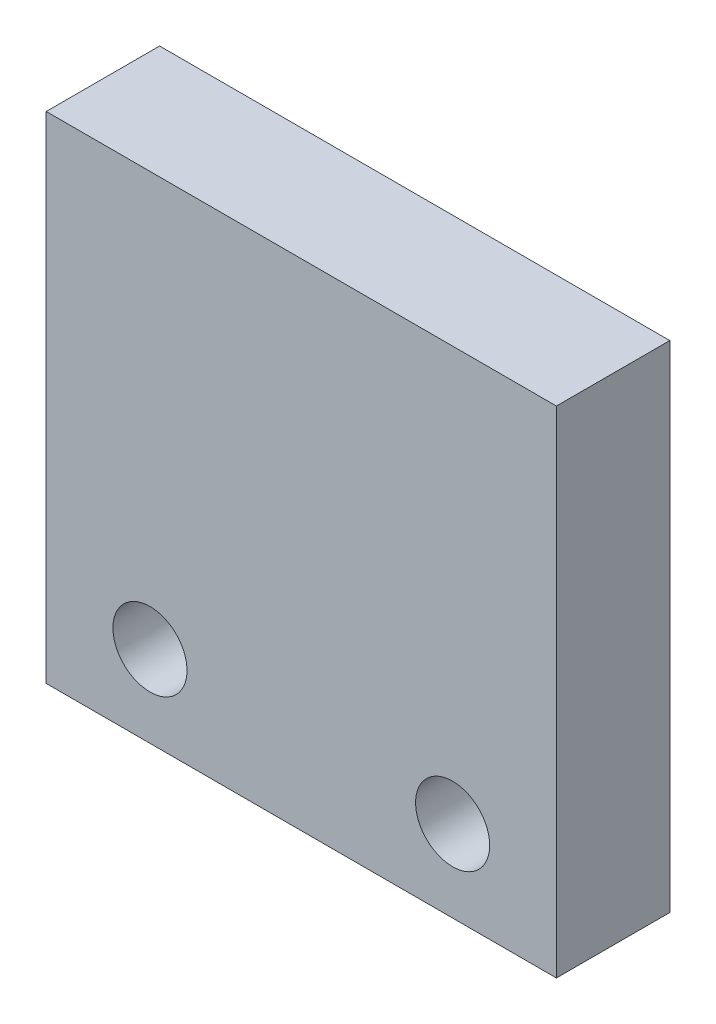
ISO-10303-21;
HEADER;
FILE_DESCRIPTION(('STEP AP214'),'2;1');
FILE_NAME('part.step','',(''),(''),'','','');
FILE_SCHEMA(('AUTOMOTIVE_DESIGN { 1 0 10303 214 1 1 1 1 }'));
ENDSEC;
DATA;
#1=APPLICATION_CONTEXT('core data for automotive mechanical design processes');
#2=APPLICATION_PROTOCOL_DEFINITION('international standard','automotive_design',2000,#1);
#3=PRODUCT_CONTEXT('',#1,'mechanical');
#4=PRODUCT('Part','Part','',(#3));
#5=PRODUCT_RELATED_PRODUCT_CATEGORY('part','',(#4));
#6=PRODUCT_DEFINITION_FORMATION('','',#4);
#7=PRODUCT_DEFINITION_CONTEXT('part definition',#1,'design');
#8=PRODUCT_DEFINITION('design','',#6,#7);
#9=PRODUCT_DEFINITION_SHAPE('','',#8);
#10=(LENGTH_UNIT() NAMED_UNIT(*) SI_UNIT(.MILLI.,.METRE.));
#11=(NAMED_UNIT(*) PLANE_ANGLE_UNIT() SI_UNIT($,.RADIAN.));
#12=(NAMED_UNIT(*) SI_UNIT($,.STERADIAN.) SOLID_ANGLE_UNIT());
#13=UNCERTAINTY_MEASURE_WITH_UNIT(LENGTH_MEASURE(1.E-05),#10,'distance_accuracy_value','');
#14=(GEOMETRIC_REPRESENTATION_CONTEXT(3) GLOBAL_UNCERTAINTY_ASSIGNED_CONTEXT((#13)) GLOBAL_UNIT_ASSIGNED_CONTEXT((#10,
#11,#12)) REPRESENTATION_CONTEXT('',''));
#15=CARTESIAN_POINT('',(0.,0.,0.));
#16=DIRECTION('',(0.,0.,1.));
#17=DIRECTION('',(1.,0.,0.));
#18=AXIS2_PLACEMENT_3D('',#15,#16,#17);
#19=CARTESIAN_POINT('',(0.,0.,7.65));
#20=DIRECTION('',(0.,0.,1.));
#21=DIRECTION('',(1.,0.,0.));
#22=AXIS2_PLACEMENT_3D('',#19,#20,#21);
#23=PLANE('',#22);
#24=CARTESIAN_POINT('',(10.21,-11.21,7.65));
#25=DIRECTION('',(0.,0.,1.));
#26=DIRECTION('',(1.,0.,0.));
#27=AXIS2_PLACEMENT_3D('',#24,#25,#26);
#28=CIRCLE('',#27,2.5);
#29=CARTESIAN_POINT('',(12.71,-11.21,7.65));
#30=VERTEX_POINT('',#29);
#31=EDGE_CURVE('E104',#30,#30,#28,.T.);
#32=ORIENTED_EDGE('',*,*,#31,.F.);
#33=EDGE_LOOP('',(#32));
#34=FACE_BOUND('',#33,.T.);
#35=DIRECTION('',(0.,1.,0.));
#36=VECTOR('',#35,1.);
#37=CARTESIAN_POINT('',(17.21,16.71,7.65));
#38=LINE('',#37,#36);
#39=CARTESIAN_POINT('',(17.21,-16.71,7.65));
#40=VERTEX_POINT('',#39);
#41=CARTESIAN_POINT('',(17.21,16.71,7.65));
#42=VERTEX_POINT('',#41);
#43=EDGE_CURVE('E89',#40,#42,#38,.T.);
#44=ORIENTED_EDGE('',*,*,#43,.T.);
#45=DIRECTION('',(-1.,0.,0.));
#46=VECTOR('',#45,1.);
#47=CARTESIAN_POINT('',(-17.21,16.71,7.65));
#48=LINE('',#47,#46);
#49=CARTESIAN_POINT('',(-17.21,16.71,7.65));
#50=VERTEX_POINT('',#49);
#51=EDGE_CURVE('E84',#42,#50,#48,.T.);
#52=ORIENTED_EDGE('',*,*,#51,.T.);
#53=DIRECTION('',(0.,-1.,0.));
#54=VECTOR('',#53,1.);
#55=CARTESIAN_POINT('',(-17.21,16.71,7.65));
#56=LINE('',#55,#54);
#57=CARTESIAN_POINT('',(-17.21,-16.71,7.65));
#58=VERTEX_POINT('',#57);
#59=EDGE_CURVE('E87',#50,#58,#56,.T.);
#60=ORIENTED_EDGE('',*,*,#59,.T.);
#61=DIRECTION('',(1.,0.,0.));
#62=VECTOR('',#61,1.);
#63=CARTESIAN_POINT('',(-17.21,-16.71,7.65));
#64=LINE('',#63,#62);
#65=EDGE_CURVE('E54',#58,#40,#64,.T.);
#66=ORIENTED_EDGE('',*,*,#65,.T.);
#67=EDGE_LOOP('',(#44,#52,#60,#66));
#68=FACE_BOUND('',#67,.T.);
#69=CARTESIAN_POINT('',(-10.21,-11.21,7.65));
#70=DIRECTION('',(0.,0.,1.));
#71=DIRECTION('',(-1.,0.,0.));
#72=AXIS2_PLACEMENT_3D('',#69,#70,#71);
#73=CIRCLE('',#72,2.5);
#74=CARTESIAN_POINT('',(-12.71,-11.21,7.65));
#75=VERTEX_POINT('',#74);
#76=EDGE_CURVE('E119',#75,#75,#73,.T.);
#77=ORIENTED_EDGE('',*,*,#76,.F.);
#78=EDGE_LOOP('',(#77));
#79=FACE_BOUND('',#78,.T.);
#80=ADVANCED_FACE('F37',(#34,#68,#79),#23,.T.);
#81=CARTESIAN_POINT('',(0.,0.,0.));
#82=DIRECTION('',(0.,0.,1.));
#83=DIRECTION('',(1.,0.,0.));
#84=AXIS2_PLACEMENT_3D('',#81,#82,#83);
#85=PLANE('',#84);
#86=DIRECTION('',(0.,1.,0.));
#87=VECTOR('',#86,1.);
#88=CARTESIAN_POINT('',(17.21,16.71,0.));
#89=LINE('',#88,#87);
#90=CARTESIAN_POINT('',(17.21,-16.71,0.));
#91=VERTEX_POINT('',#90);
#92=CARTESIAN_POINT('',(17.21,16.71,0.));
#93=VERTEX_POINT('',#92);
#94=EDGE_CURVE('E101',#91,#93,#89,.T.);
#95=ORIENTED_EDGE('',*,*,#94,.F.);
#96=DIRECTION('',(1.,0.,0.));
#97=VECTOR('',#96,1.);
#98=CARTESIAN_POINT('',(-17.21,-16.71,0.));
#99=LINE('',#98,#97);
#100=CARTESIAN_POINT('',(-17.21,-16.71,0.));
#101=VERTEX_POINT('',#100);
#102=EDGE_CURVE('E77',#101,#91,#99,.T.);
#103=ORIENTED_EDGE('',*,*,#102,.F.);
#104=DIRECTION('',(0.,-1.,0.));
#105=VECTOR('',#104,1.);
#106=CARTESIAN_POINT('',(-17.21,16.71,0.));
#107=LINE('',#106,#105);
#108=CARTESIAN_POINT('',(-17.21,16.71,0.));
#109=VERTEX_POINT('',#108);
#110=EDGE_CURVE('E71',#109,#101,#107,.T.);
#111=ORIENTED_EDGE('',*,*,#110,.F.);
#112=DIRECTION('',(-1.,0.,0.));
#113=VECTOR('',#112,1.);
#114=CARTESIAN_POINT('',(-17.21,16.71,0.));
#115=LINE('',#114,#113);
#116=EDGE_CURVE('E93',#93,#109,#115,.T.);
#117=ORIENTED_EDGE('',*,*,#116,.F.);
#118=EDGE_LOOP('',(#95,#103,#111,#117));
#119=FACE_BOUND('',#118,.T.);
#120=CARTESIAN_POINT('',(10.21,-11.21,0.));
#121=DIRECTION('',(0.,0.,1.));
#122=DIRECTION('',(1.,0.,0.));
#123=AXIS2_PLACEMENT_3D('',#120,#121,#122);
#124=CIRCLE('',#123,2.5);
#125=CARTESIAN_POINT('',(12.71,-11.21,0.));
#126=VERTEX_POINT('',#125);
#127=EDGE_CURVE('E116',#126,#126,#124,.T.);
#128=ORIENTED_EDGE('',*,*,#127,.T.);
#129=EDGE_LOOP('',(#128));
#130=FACE_BOUND('',#129,.T.);
#131=CARTESIAN_POINT('',(-10.21,-11.21,0.));
#132=DIRECTION('',(0.,0.,1.));
#133=DIRECTION('',(-1.,0.,0.));
#134=AXIS2_PLACEMENT_3D('',#131,#132,#133);
#135=CIRCLE('',#134,2.5);
#136=CARTESIAN_POINT('',(-12.71,-11.21,0.));
#137=VERTEX_POINT('',#136);
#138=EDGE_CURVE('E122',#137,#137,#135,.T.);
#139=ORIENTED_EDGE('',*,*,#138,.T.);
#140=EDGE_LOOP('',(#139));
#141=FACE_BOUND('',#140,.T.);
#142=ADVANCED_FACE('F112',(#119,#130,#141),#85,.F.);
#143=CARTESIAN_POINT('',(17.21,16.71,7.65));
#144=DIRECTION('',(-1.,0.,0.));
#145=DIRECTION('',(0.,-1.,0.));
#146=AXIS2_PLACEMENT_3D('',#143,#144,#145);
#147=PLANE('',#146);
#148=ORIENTED_EDGE('',*,*,#94,.T.);
#149=DIRECTION('',(0.,0.,-1.));
#150=VECTOR('',#149,1.);
#151=CARTESIAN_POINT('',(17.21,16.71,7.65));
#152=LINE('',#151,#150);
#153=EDGE_CURVE('E11',#42,#93,#152,.T.);
#154=ORIENTED_EDGE('',*,*,#153,.F.);
#155=ORIENTED_EDGE('',*,*,#43,.F.);
#156=DIRECTION('',(0.,0.,-1.));
#157=VECTOR('',#156,1.);
#158=CARTESIAN_POINT('',(17.21,-16.71,7.65));
#159=LINE('',#158,#157);
#160=EDGE_CURVE('E97',#40,#91,#159,.T.);
#161=ORIENTED_EDGE('',*,*,#160,.T.);
#162=EDGE_LOOP('',(#148,#154,#155,#161));
#163=FACE_BOUND('',#162,.T.);
#164=ADVANCED_FACE('F39',(#163),#147,.F.);
#165=CARTESIAN_POINT('',(-17.21,16.71,7.65));
#166=DIRECTION('',(0.,-1.,0.));
#167=DIRECTION('',(0.,0.,-1.));
#168=AXIS2_PLACEMENT_3D('',#165,#166,#167);
#169=PLANE('',#168);
#170=ORIENTED_EDGE('',*,*,#116,.T.);
#171=DIRECTION('',(0.,0.,-1.));
#172=VECTOR('',#171,1.);
#173=CARTESIAN_POINT('',(-17.21,16.71,7.65));
#174=LINE('',#173,#172);
#175=EDGE_CURVE('E46',#50,#109,#174,.T.);
#176=ORIENTED_EDGE('',*,*,#175,.F.);
#177=ORIENTED_EDGE('',*,*,#51,.F.);
#178=ORIENTED_EDGE('',*,*,#153,.T.);
#179=EDGE_LOOP('',(#170,#176,#177,#178));
#180=FACE_BOUND('',#179,.T.);
#181=ADVANCED_FACE('F92',(#180),#169,.F.);
#182=CARTESIAN_POINT('',(-17.21,16.71,7.65));
#183=DIRECTION('',(1.,0.,0.));
#184=DIRECTION('',(0.,1.,0.));
#185=AXIS2_PLACEMENT_3D('',#182,#183,#184);
#186=PLANE('',#185);
#187=ORIENTED_EDGE('',*,*,#110,.T.);
#188=DIRECTION('',(0.,0.,-1.));
#189=VECTOR('',#188,1.);
#190=CARTESIAN_POINT('',(-17.21,-16.71,7.65));
#191=LINE('',#190,#189);
#192=EDGE_CURVE('E94',#58,#101,#191,.T.);
#193=ORIENTED_EDGE('',*,*,#192,.F.);
#194=ORIENTED_EDGE('',*,*,#59,.F.);
#195=ORIENTED_EDGE('',*,*,#175,.T.);
#196=EDGE_LOOP('',(#187,#193,#194,#195));
#197=FACE_BOUND('',#196,.T.);
#198=ADVANCED_FACE('F95',(#197),#186,.F.);
#199=CARTESIAN_POINT('',(-17.21,-16.71,7.65));
#200=DIRECTION('',(0.,1.,0.));
#201=DIRECTION('',(0.,0.,1.));
#202=AXIS2_PLACEMENT_3D('',#199,#200,#201);
#203=PLANE('',#202);
#204=ORIENTED_EDGE('',*,*,#102,.T.);
#205=ORIENTED_EDGE('',*,*,#160,.F.);
#206=ORIENTED_EDGE('',*,*,#65,.F.);
#207=ORIENTED_EDGE('',*,*,#192,.T.);
#208=EDGE_LOOP('',(#204,#205,#206,#207));
#209=FACE_BOUND('',#208,.T.);
#210=ADVANCED_FACE('F109',(#209),#203,.F.);
#211=CARTESIAN_POINT('',(10.21,-11.21,7.65));
#212=DIRECTION('',(0.,0.,-1.));
#213=DIRECTION('',(-1.,0.,0.));
#214=AXIS2_PLACEMENT_3D('',#211,#212,#213);
#215=CYLINDRICAL_SURFACE('',#214,2.5);
#216=ORIENTED_EDGE('',*,*,#31,.T.);
#217=EDGE_LOOP('',(#216));
#218=FACE_BOUND('',#217,.T.);
#219=ORIENTED_EDGE('',*,*,#127,.F.);
#220=EDGE_LOOP('',(#219));
#221=FACE_BOUND('',#220,.T.);
#222=ADVANCED_FACE('F139',(#218,#221),#215,.F.);
#223=CARTESIAN_POINT('',(-10.21,-11.21,7.65));
#224=DIRECTION('',(0.,0.,-1.));
#225=DIRECTION('',(-1.,0.,0.));
#226=AXIS2_PLACEMENT_3D('',#223,#224,#225);
#227=CYLINDRICAL_SURFACE('',#226,2.5);
#228=ORIENTED_EDGE('',*,*,#76,.T.);
#229=EDGE_LOOP('',(#228));
#230=FACE_BOUND('',#229,.T.);
#231=ORIENTED_EDGE('',*,*,#138,.F.);
#232=EDGE_LOOP('',(#231));
#233=FACE_BOUND('',#232,.T.);
#234=ADVANCED_FACE('F128',(#230,#233),#227,.F.);
#235=CLOSED_SHELL('',(#80,#142,#164,#181,#198,#210,#222,#234));
#236=MANIFOLD_SOLID_BREP('B2',#235);
#237=ADVANCED_BREP_SHAPE_REPRESENTATION('',(#18,#236),#14);
#238=SHAPE_DEFINITION_REPRESENTATION(#9,#237);
ENDSEC;
END-ISO-10303-21;
